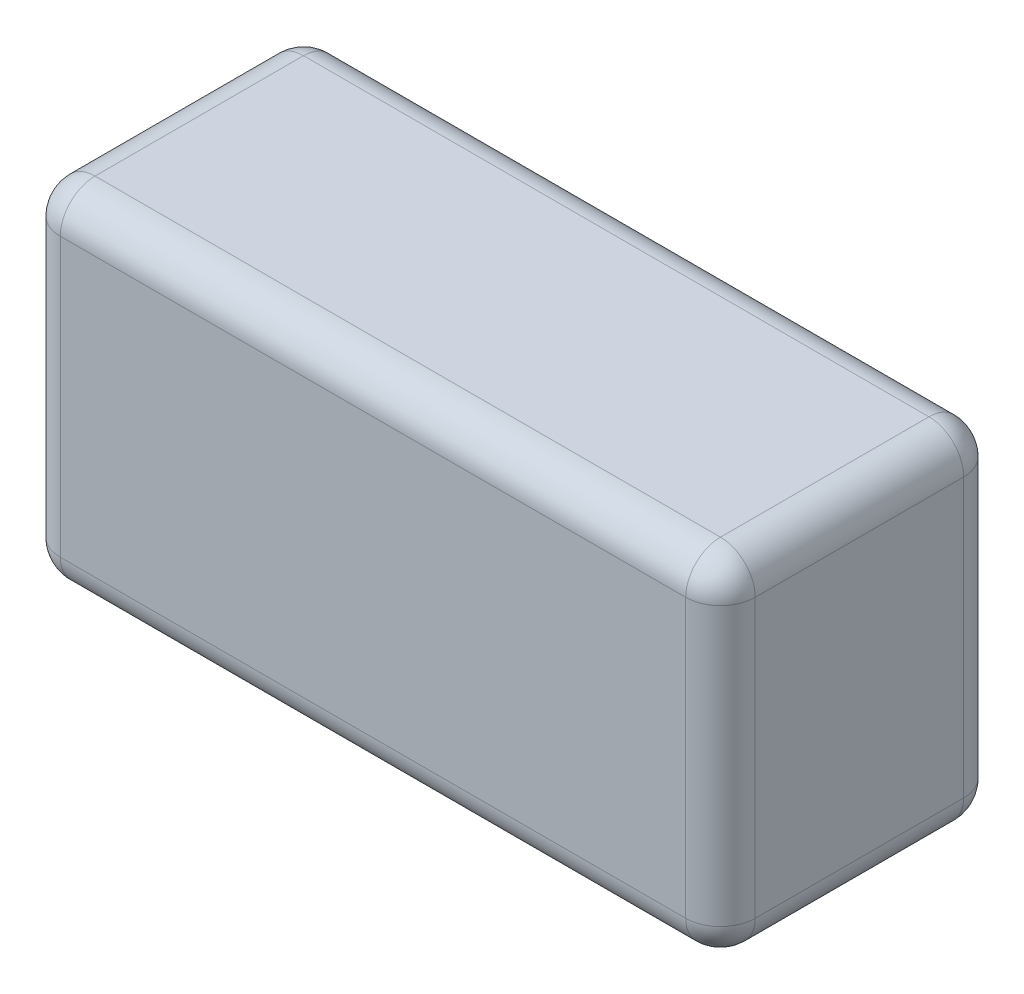
ISO-10303-21;
HEADER;
FILE_DESCRIPTION(('STEP AP214'),'2;1');
FILE_NAME('part.step','',(''),(''),'','','');
FILE_SCHEMA(('AUTOMOTIVE_DESIGN { 1 0 10303 214 1 1 1 1 }'));
ENDSEC;
DATA;
#1=APPLICATION_CONTEXT('core data for automotive mechanical design processes');
#2=APPLICATION_PROTOCOL_DEFINITION('international standard','automotive_design',2000,#1);
#3=PRODUCT_CONTEXT('',#1,'mechanical');
#4=PRODUCT('Part','Part','',(#3));
#5=PRODUCT_RELATED_PRODUCT_CATEGORY('part','',(#4));
#6=PRODUCT_DEFINITION_FORMATION('','',#4);
#7=PRODUCT_DEFINITION_CONTEXT('part definition',#1,'design');
#8=PRODUCT_DEFINITION('design','',#6,#7);
#9=PRODUCT_DEFINITION_SHAPE('','',#8);
#10=(LENGTH_UNIT() NAMED_UNIT(*) SI_UNIT(.MILLI.,.METRE.));
#11=(NAMED_UNIT(*) PLANE_ANGLE_UNIT() SI_UNIT($,.RADIAN.));
#12=(NAMED_UNIT(*) SI_UNIT($,.STERADIAN.) SOLID_ANGLE_UNIT());
#13=UNCERTAINTY_MEASURE_WITH_UNIT(LENGTH_MEASURE(1.E-05),#10,'distance_accuracy_value','');
#14=(GEOMETRIC_REPRESENTATION_CONTEXT(3) GLOBAL_UNCERTAINTY_ASSIGNED_CONTEXT((#13)) GLOBAL_UNIT_ASSIGNED_CONTEXT((#10,
#11,#12)) REPRESENTATION_CONTEXT('',''));
#15=CARTESIAN_POINT('',(0.,0.,0.));
#16=DIRECTION('',(0.,0.,1.));
#17=DIRECTION('',(1.,0.,0.));
#18=AXIS2_PLACEMENT_3D('',#15,#16,#17);
#19=CARTESIAN_POINT('',(31.75,-15.875,25.4));
#20=DIRECTION('',(-1.,0.,0.));
#21=DIRECTION('',(0.,0.,1.));
#22=AXIS2_PLACEMENT_3D('',#19,#20,#21);
#23=PLANE('',#22);
#24=DIRECTION('',(0.,0.,-1.));
#25=VECTOR('',#24,1.);
#26=CARTESIAN_POINT('',(31.75,12.7,25.4));
#27=LINE('',#26,#25);
#28=CARTESIAN_POINT('',(31.75,12.7,3.175));
#29=VERTEX_POINT('',#28);
#30=CARTESIAN_POINT('',(31.75,12.7,22.225));
#31=VERTEX_POINT('',#30);
#32=EDGE_CURVE('E135',#29,#31,#27,.F.);
#33=ORIENTED_EDGE('',*,*,#32,.T.);
#34=DIRECTION('',(0.,1.,0.));
#35=VECTOR('',#34,1.);
#36=CARTESIAN_POINT('',(31.75,-15.875,22.225));
#37=LINE('',#36,#35);
#38=CARTESIAN_POINT('',(31.75,-12.7,22.225));
#39=VERTEX_POINT('',#38);
#40=EDGE_CURVE('E172',#31,#39,#37,.F.);
#41=ORIENTED_EDGE('',*,*,#40,.T.);
#42=DIRECTION('',(0.,0.,-1.));
#43=VECTOR('',#42,1.);
#44=CARTESIAN_POINT('',(31.75,-12.7,25.4));
#45=LINE('',#44,#43);
#46=CARTESIAN_POINT('',(31.75,-12.7,3.175));
#47=VERTEX_POINT('',#46);
#48=EDGE_CURVE('E169',#39,#47,#45,.T.);
#49=ORIENTED_EDGE('',*,*,#48,.T.);
#50=DIRECTION('',(0.,1.,0.));
#51=VECTOR('',#50,1.);
#52=CARTESIAN_POINT('',(31.75,15.875,3.175));
#53=LINE('',#52,#51);
#54=EDGE_CURVE('E164',#47,#29,#53,.T.);
#55=ORIENTED_EDGE('',*,*,#54,.T.);
#56=EDGE_LOOP('',(#33,#41,#49,#55));
#57=FACE_BOUND('',#56,.T.);
#58=ADVANCED_FACE('F40',(#57),#23,.F.);
#59=CARTESIAN_POINT('',(-31.75,15.875,25.4));
#60=DIRECTION('',(0.,-1.,0.));
#61=DIRECTION('',(0.,0.,-1.));
#62=AXIS2_PLACEMENT_3D('',#59,#60,#61);
#63=PLANE('',#62);
#64=DIRECTION('',(0.,0.,-1.));
#65=VECTOR('',#64,1.);
#66=CARTESIAN_POINT('',(-28.575,15.875,25.4));
#67=LINE('',#66,#65);
#68=CARTESIAN_POINT('',(-28.575,15.875,3.175));
#69=VERTEX_POINT('',#68);
#70=CARTESIAN_POINT('',(-28.575,15.875,22.225));
#71=VERTEX_POINT('',#70);
#72=EDGE_CURVE('E157',#69,#71,#67,.F.);
#73=ORIENTED_EDGE('',*,*,#72,.T.);
#74=DIRECTION('',(-1.,0.,0.));
#75=VECTOR('',#74,1.);
#76=CARTESIAN_POINT('',(-31.75,15.875,22.225));
#77=LINE('',#76,#75);
#78=CARTESIAN_POINT('',(28.575,15.875,22.225));
#79=VERTEX_POINT('',#78);
#80=EDGE_CURVE('E161',#71,#79,#77,.F.);
#81=ORIENTED_EDGE('',*,*,#80,.T.);
#82=DIRECTION('',(0.,0.,-1.));
#83=VECTOR('',#82,1.);
#84=CARTESIAN_POINT('',(28.575,15.875,25.4));
#85=LINE('',#84,#83);
#86=CARTESIAN_POINT('',(28.575,15.875,3.175));
#87=VERTEX_POINT('',#86);
#88=EDGE_CURVE('E133',#79,#87,#85,.T.);
#89=ORIENTED_EDGE('',*,*,#88,.T.);
#90=DIRECTION('',(-1.,0.,0.));
#91=VECTOR('',#90,1.);
#92=CARTESIAN_POINT('',(-31.75,15.875,3.175));
#93=LINE('',#92,#91);
#94=EDGE_CURVE('E151',#87,#69,#93,.T.);
#95=ORIENTED_EDGE('',*,*,#94,.T.);
#96=EDGE_LOOP('',(#73,#81,#89,#95));
#97=FACE_BOUND('',#96,.T.);
#98=ADVANCED_FACE('F159',(#97),#63,.F.);
#99=CARTESIAN_POINT('',(-31.75,-15.875,25.4));
#100=DIRECTION('',(1.,0.,0.));
#101=DIRECTION('',(0.,0.,-1.));
#102=AXIS2_PLACEMENT_3D('',#99,#100,#101);
#103=PLANE('',#102);
#104=DIRECTION('',(0.,0.,-1.));
#105=VECTOR('',#104,1.);
#106=CARTESIAN_POINT('',(-31.75,-12.7,25.4));
#107=LINE('',#106,#105);
#108=CARTESIAN_POINT('',(-31.75,-12.7,3.175));
#109=VERTEX_POINT('',#108);
#110=CARTESIAN_POINT('',(-31.75,-12.7,22.225));
#111=VERTEX_POINT('',#110);
#112=EDGE_CURVE('E176',#109,#111,#107,.F.);
#113=ORIENTED_EDGE('',*,*,#112,.T.);
#114=DIRECTION('',(0.,-1.,0.));
#115=VECTOR('',#114,1.);
#116=CARTESIAN_POINT('',(-31.75,-15.875,22.225));
#117=LINE('',#116,#115);
#118=CARTESIAN_POINT('',(-31.75,12.7,22.225));
#119=VERTEX_POINT('',#118);
#120=EDGE_CURVE('E181',#111,#119,#117,.F.);
#121=ORIENTED_EDGE('',*,*,#120,.T.);
#122=DIRECTION('',(0.,0.,-1.));
#123=VECTOR('',#122,1.);
#124=CARTESIAN_POINT('',(-31.75,12.7,25.4));
#125=LINE('',#124,#123);
#126=CARTESIAN_POINT('',(-31.75,12.7,3.175));
#127=VERTEX_POINT('',#126);
#128=EDGE_CURVE('E178',#119,#127,#125,.T.);
#129=ORIENTED_EDGE('',*,*,#128,.T.);
#130=DIRECTION('',(0.,-1.,0.));
#131=VECTOR('',#130,1.);
#132=CARTESIAN_POINT('',(-31.75,-15.875,3.175));
#133=LINE('',#132,#131);
#134=EDGE_CURVE('E174',#127,#109,#133,.T.);
#135=ORIENTED_EDGE('',*,*,#134,.T.);
#136=EDGE_LOOP('',(#113,#121,#129,#135));
#137=FACE_BOUND('',#136,.T.);
#138=ADVANCED_FACE('F286',(#137),#103,.F.);
#139=CARTESIAN_POINT('',(-31.75,-15.875,25.4));
#140=DIRECTION('',(0.,1.,0.));
#141=DIRECTION('',(0.,0.,1.));
#142=AXIS2_PLACEMENT_3D('',#139,#140,#141);
#143=PLANE('',#142);
#144=DIRECTION('',(0.,0.,-1.));
#145=VECTOR('',#144,1.);
#146=CARTESIAN_POINT('',(28.575,-15.875,25.4));
#147=LINE('',#146,#145);
#148=CARTESIAN_POINT('',(28.575,-15.875,3.175));
#149=VERTEX_POINT('',#148);
#150=CARTESIAN_POINT('',(28.575,-15.875,22.225));
#151=VERTEX_POINT('',#150);
#152=EDGE_CURVE('E185',#149,#151,#147,.F.);
#153=ORIENTED_EDGE('',*,*,#152,.T.);
#154=DIRECTION('',(1.,0.,0.));
#155=VECTOR('',#154,1.);
#156=CARTESIAN_POINT('',(-31.75,-15.875,22.225));
#157=LINE('',#156,#155);
#158=CARTESIAN_POINT('',(-28.575,-15.875,22.225));
#159=VERTEX_POINT('',#158);
#160=EDGE_CURVE('E190',#151,#159,#157,.F.);
#161=ORIENTED_EDGE('',*,*,#160,.T.);
#162=DIRECTION('',(0.,0.,-1.));
#163=VECTOR('',#162,1.);
#164=CARTESIAN_POINT('',(-28.575,-15.875,25.4));
#165=LINE('',#164,#163);
#166=CARTESIAN_POINT('',(-28.575,-15.875,3.175));
#167=VERTEX_POINT('',#166);
#168=EDGE_CURVE('E187',#159,#167,#165,.T.);
#169=ORIENTED_EDGE('',*,*,#168,.T.);
#170=DIRECTION('',(1.,0.,0.));
#171=VECTOR('',#170,1.);
#172=CARTESIAN_POINT('',(31.75,-15.875,3.175));
#173=LINE('',#172,#171);
#174=EDGE_CURVE('E183',#167,#149,#173,.T.);
#175=ORIENTED_EDGE('',*,*,#174,.T.);
#176=EDGE_LOOP('',(#153,#161,#169,#175));
#177=FACE_BOUND('',#176,.T.);
#178=ADVANCED_FACE('F296',(#177),#143,.F.);
#179=CARTESIAN_POINT('',(0.,0.,25.4));
#180=DIRECTION('',(0.,0.,-1.));
#181=DIRECTION('',(-1.,0.,0.));
#182=AXIS2_PLACEMENT_3D('',#179,#180,#181);
#183=PLANE('',#182);
#184=DIRECTION('',(0.,-1.,0.));
#185=VECTOR('',#184,1.);
#186=CARTESIAN_POINT('',(-28.575,0.,25.4));
#187=LINE('',#186,#185);
#188=CARTESIAN_POINT('',(-28.575,12.7,25.4));
#189=VERTEX_POINT('',#188);
#190=CARTESIAN_POINT('',(-28.575,-12.7,25.4));
#191=VERTEX_POINT('',#190);
#192=EDGE_CURVE('E196',#189,#191,#187,.T.);
#193=ORIENTED_EDGE('',*,*,#192,.T.);
#194=DIRECTION('',(1.,0.,0.));
#195=VECTOR('',#194,1.);
#196=CARTESIAN_POINT('',(0.,-12.7,25.4));
#197=LINE('',#196,#195);
#198=CARTESIAN_POINT('',(28.575,-12.7,25.4));
#199=VERTEX_POINT('',#198);
#200=EDGE_CURVE('E198',#191,#199,#197,.T.);
#201=ORIENTED_EDGE('',*,*,#200,.T.);
#202=DIRECTION('',(0.,1.,0.));
#203=VECTOR('',#202,1.);
#204=CARTESIAN_POINT('',(28.575,0.,25.4));
#205=LINE('',#204,#203);
#206=CARTESIAN_POINT('',(28.575,12.7,25.4));
#207=VERTEX_POINT('',#206);
#208=EDGE_CURVE('E192',#199,#207,#205,.T.);
#209=ORIENTED_EDGE('',*,*,#208,.T.);
#210=DIRECTION('',(-1.,0.,0.));
#211=VECTOR('',#210,1.);
#212=CARTESIAN_POINT('',(0.,12.7,25.4));
#213=LINE('',#212,#211);
#214=EDGE_CURVE('E194',#207,#189,#213,.T.);
#215=ORIENTED_EDGE('',*,*,#214,.T.);
#216=EDGE_LOOP('',(#193,#201,#209,#215));
#217=FACE_BOUND('',#216,.T.);
#218=ADVANCED_FACE('F278',(#217),#183,.F.);
#219=CARTESIAN_POINT('',(0.,0.,0.));
#220=DIRECTION('',(0.,0.,-1.));
#221=DIRECTION('',(-1.,0.,0.));
#222=AXIS2_PLACEMENT_3D('',#219,#220,#221);
#223=PLANE('',#222);
#224=DIRECTION('',(0.,1.,0.));
#225=VECTOR('',#224,1.);
#226=CARTESIAN_POINT('',(28.575,-15.875,0.));
#227=LINE('',#226,#225);
#228=CARTESIAN_POINT('',(28.575,12.7,0.));
#229=VERTEX_POINT('',#228);
#230=CARTESIAN_POINT('',(28.575,-12.7,0.));
#231=VERTEX_POINT('',#230);
#232=EDGE_CURVE('E201',#229,#231,#227,.F.);
#233=ORIENTED_EDGE('',*,*,#232,.T.);
#234=DIRECTION('',(1.,0.,0.));
#235=VECTOR('',#234,1.);
#236=CARTESIAN_POINT('',(-31.75,-12.7,0.));
#237=LINE('',#236,#235);
#238=CARTESIAN_POINT('',(-28.575,-12.7,0.));
#239=VERTEX_POINT('',#238);
#240=EDGE_CURVE('E11',#231,#239,#237,.F.);
#241=ORIENTED_EDGE('',*,*,#240,.T.);
#242=DIRECTION('',(0.,-1.,0.));
#243=VECTOR('',#242,1.);
#244=CARTESIAN_POINT('',(-28.575,15.875,0.));
#245=LINE('',#244,#243);
#246=CARTESIAN_POINT('',(-28.575,12.7,0.));
#247=VERTEX_POINT('',#246);
#248=EDGE_CURVE('E49',#239,#247,#245,.F.);
#249=ORIENTED_EDGE('',*,*,#248,.T.);
#250=DIRECTION('',(-1.,0.,0.));
#251=VECTOR('',#250,1.);
#252=CARTESIAN_POINT('',(31.75,12.7,0.));
#253=LINE('',#252,#251);
#254=EDGE_CURVE('E203',#247,#229,#253,.F.);
#255=ORIENTED_EDGE('',*,*,#254,.T.);
#256=EDGE_LOOP('',(#233,#241,#249,#255));
#257=FACE_BOUND('',#256,.T.);
#258=ADVANCED_FACE('F485',(#257),#223,.T.);
#259=CARTESIAN_POINT('',(-28.575,-12.7,25.4));
#260=DIRECTION('',(0.,0.,-1.));
#261=DIRECTION('',(-1.,0.,0.));
#262=AXIS2_PLACEMENT_3D('',#259,#260,#261);
#263=CYLINDRICAL_SURFACE('',#262,3.175);
#264=CARTESIAN_POINT('',(-28.575,-12.7,22.225));
#265=DIRECTION('',(0.,0.,1.));
#266=DIRECTION('',(1.,0.,0.));
#267=AXIS2_PLACEMENT_3D('',#264,#265,#266);
#268=CIRCLE('',#267,3.175);
#269=EDGE_CURVE('E44',#111,#159,#268,.T.);
#270=ORIENTED_EDGE('',*,*,#269,.F.);
#271=ORIENTED_EDGE('',*,*,#112,.F.);
#272=CARTESIAN_POINT('',(-28.575,-12.7,3.175));
#273=DIRECTION('',(0.,0.,-1.));
#274=DIRECTION('',(-1.,0.,0.));
#275=AXIS2_PLACEMENT_3D('',#272,#273,#274);
#276=CIRCLE('',#275,3.175);
#277=EDGE_CURVE('E256',#167,#109,#276,.T.);
#278=ORIENTED_EDGE('',*,*,#277,.F.);
#279=ORIENTED_EDGE('',*,*,#168,.F.);
#280=EDGE_LOOP('',(#270,#271,#278,#279));
#281=FACE_BOUND('',#280,.T.);
#282=ADVANCED_FACE('F42',(#281),#263,.T.);
#283=CARTESIAN_POINT('',(-28.575,-12.7,22.225));
#284=DIRECTION('',(0.,0.,1.));
#285=DIRECTION('',(1.,0.,0.));
#286=AXIS2_PLACEMENT_3D('',#283,#284,#285);
#287=SPHERICAL_SURFACE('',#286,3.175);
#288=CARTESIAN_POINT('',(-28.575,-12.7,22.225));
#289=DIRECTION('',(0.,-1.,0.));
#290=DIRECTION('',(0.,0.,-1.));
#291=AXIS2_PLACEMENT_3D('',#288,#289,#290);
#292=CIRCLE('',#291,3.175);
#293=EDGE_CURVE('E251',#111,#191,#292,.F.);
#294=ORIENTED_EDGE('',*,*,#293,.F.);
#295=ORIENTED_EDGE('',*,*,#269,.T.);
#296=CARTESIAN_POINT('',(-28.575,-12.7,22.225));
#297=DIRECTION('',(-1.,0.,0.));
#298=DIRECTION('',(0.,0.,1.));
#299=AXIS2_PLACEMENT_3D('',#296,#297,#298);
#300=CIRCLE('',#299,3.175);
#301=EDGE_CURVE('E254',#191,#159,#300,.F.);
#302=ORIENTED_EDGE('',*,*,#301,.F.);
#303=EDGE_LOOP('',(#294,#295,#302));
#304=FACE_BOUND('',#303,.T.);
#305=ADVANCED_FACE('F266',(#304),#287,.T.);
#306=CARTESIAN_POINT('',(-28.575,-12.7,3.175));
#307=DIRECTION('',(0.,0.,1.));
#308=DIRECTION('',(1.,0.,0.));
#309=AXIS2_PLACEMENT_3D('',#306,#307,#308);
#310=SPHERICAL_SURFACE('',#309,3.175);
#311=CARTESIAN_POINT('',(-28.575,-12.7,3.175));
#312=DIRECTION('',(-1.,0.,0.));
#313=DIRECTION('',(0.,0.,1.));
#314=AXIS2_PLACEMENT_3D('',#311,#312,#313);
#315=CIRCLE('',#314,3.175);
#316=EDGE_CURVE('E246',#167,#239,#315,.F.);
#317=ORIENTED_EDGE('',*,*,#316,.F.);
#318=ORIENTED_EDGE('',*,*,#277,.T.);
#319=CARTESIAN_POINT('',(-28.575,-12.7,3.175));
#320=DIRECTION('',(0.,-1.,0.));
#321=DIRECTION('',(0.,0.,-1.));
#322=AXIS2_PLACEMENT_3D('',#319,#320,#321);
#323=CIRCLE('',#322,3.175);
#324=EDGE_CURVE('E249',#239,#109,#323,.F.);
#325=ORIENTED_EDGE('',*,*,#324,.F.);
#326=EDGE_LOOP('',(#317,#318,#325));
#327=FACE_BOUND('',#326,.T.);
#328=ADVANCED_FACE('F464',(#327),#310,.T.);
#329=CARTESIAN_POINT('',(0.,-12.7,22.225));
#330=DIRECTION('',(1.,0.,0.));
#331=DIRECTION('',(0.,0.,-1.));
#332=AXIS2_PLACEMENT_3D('',#329,#330,#331);
#333=CYLINDRICAL_SURFACE('',#332,3.175);
#334=ORIENTED_EDGE('',*,*,#301,.T.);
#335=ORIENTED_EDGE('',*,*,#160,.F.);
#336=CARTESIAN_POINT('',(28.575,-12.7,22.225));
#337=DIRECTION('',(1.,0.,0.));
#338=DIRECTION('',(0.,0.,-1.));
#339=AXIS2_PLACEMENT_3D('',#336,#337,#338);
#340=CIRCLE('',#339,3.175);
#341=EDGE_CURVE('E240',#199,#151,#340,.T.);
#342=ORIENTED_EDGE('',*,*,#341,.F.);
#343=ORIENTED_EDGE('',*,*,#200,.F.);
#344=EDGE_LOOP('',(#334,#335,#342,#343));
#345=FACE_BOUND('',#344,.T.);
#346=ADVANCED_FACE('F274',(#345),#333,.T.);
#347=CARTESIAN_POINT('',(-28.575,0.,22.225));
#348=DIRECTION('',(0.,-1.,0.));
#349=DIRECTION('',(0.,0.,-1.));
#350=AXIS2_PLACEMENT_3D('',#347,#348,#349);
#351=CYLINDRICAL_SURFACE('',#350,3.175);
#352=ORIENTED_EDGE('',*,*,#293,.T.);
#353=ORIENTED_EDGE('',*,*,#192,.F.);
#354=CARTESIAN_POINT('',(-28.575,12.7,22.225));
#355=DIRECTION('',(0.,1.,0.));
#356=DIRECTION('',(0.,0.,1.));
#357=AXIS2_PLACEMENT_3D('',#354,#355,#356);
#358=CIRCLE('',#357,3.175);
#359=EDGE_CURVE('E237',#119,#189,#358,.T.);
#360=ORIENTED_EDGE('',*,*,#359,.F.);
#361=ORIENTED_EDGE('',*,*,#120,.F.);
#362=EDGE_LOOP('',(#352,#353,#360,#361));
#363=FACE_BOUND('',#362,.T.);
#364=ADVANCED_FACE('F283',(#363),#351,.T.);
#365=CARTESIAN_POINT('',(-28.575,12.7,25.4));
#366=DIRECTION('',(0.,0.,-1.));
#367=DIRECTION('',(-1.,0.,0.));
#368=AXIS2_PLACEMENT_3D('',#365,#366,#367);
#369=CYLINDRICAL_SURFACE('',#368,3.175);
#370=CARTESIAN_POINT('',(-28.575,12.7,3.175));
#371=DIRECTION('',(0.,0.,-1.));
#372=DIRECTION('',(-1.,0.,0.));
#373=AXIS2_PLACEMENT_3D('',#370,#371,#372);
#374=CIRCLE('',#373,3.175);
#375=EDGE_CURVE('E231',#127,#69,#374,.T.);
#376=ORIENTED_EDGE('',*,*,#375,.F.);
#377=ORIENTED_EDGE('',*,*,#128,.F.);
#378=CARTESIAN_POINT('',(-28.575,12.7,22.225));
#379=DIRECTION('',(0.,0.,1.));
#380=DIRECTION('',(1.,0.,0.));
#381=AXIS2_PLACEMENT_3D('',#378,#379,#380);
#382=CIRCLE('',#381,3.175);
#383=EDGE_CURVE('E234',#71,#119,#382,.T.);
#384=ORIENTED_EDGE('',*,*,#383,.F.);
#385=ORIENTED_EDGE('',*,*,#72,.F.);
#386=EDGE_LOOP('',(#376,#377,#384,#385));
#387=FACE_BOUND('',#386,.T.);
#388=ADVANCED_FACE('F290',(#387),#369,.T.);
#389=CARTESIAN_POINT('',(-28.575,-15.875,3.175));
#390=DIRECTION('',(0.,1.,0.));
#391=DIRECTION('',(0.,0.,1.));
#392=AXIS2_PLACEMENT_3D('',#389,#390,#391);
#393=CYLINDRICAL_SURFACE('',#392,3.175);
#394=ORIENTED_EDGE('',*,*,#324,.T.);
#395=ORIENTED_EDGE('',*,*,#134,.F.);
#396=CARTESIAN_POINT('',(-28.575,12.7,3.175));
#397=DIRECTION('',(0.,1.,0.));
#398=DIRECTION('',(0.,0.,1.));
#399=AXIS2_PLACEMENT_3D('',#396,#397,#398);
#400=CIRCLE('',#399,3.175);
#401=EDGE_CURVE('E229',#247,#127,#400,.T.);
#402=ORIENTED_EDGE('',*,*,#401,.F.);
#403=ORIENTED_EDGE('',*,*,#248,.F.);
#404=EDGE_LOOP('',(#394,#395,#402,#403));
#405=FACE_BOUND('',#404,.T.);
#406=ADVANCED_FACE('F294',(#405),#393,.T.);
#407=CARTESIAN_POINT('',(-31.75,-12.7,3.175));
#408=DIRECTION('',(-1.,0.,0.));
#409=DIRECTION('',(0.,0.,1.));
#410=AXIS2_PLACEMENT_3D('',#407,#408,#409);
#411=CYLINDRICAL_SURFACE('',#410,3.175);
#412=ORIENTED_EDGE('',*,*,#316,.T.);
#413=ORIENTED_EDGE('',*,*,#240,.F.);
#414=CARTESIAN_POINT('',(28.575,-12.7,3.175));
#415=DIRECTION('',(1.,0.,0.));
#416=DIRECTION('',(0.,0.,-1.));
#417=AXIS2_PLACEMENT_3D('',#414,#415,#416);
#418=CIRCLE('',#417,3.175);
#419=EDGE_CURVE('E226',#149,#231,#418,.T.);
#420=ORIENTED_EDGE('',*,*,#419,.F.);
#421=ORIENTED_EDGE('',*,*,#174,.F.);
#422=EDGE_LOOP('',(#412,#413,#420,#421));
#423=FACE_BOUND('',#422,.T.);
#424=ADVANCED_FACE('F306',(#423),#411,.T.);
#425=CARTESIAN_POINT('',(28.575,-12.7,25.4));
#426=DIRECTION('',(0.,0.,-1.));
#427=DIRECTION('',(-1.,0.,0.));
#428=AXIS2_PLACEMENT_3D('',#425,#426,#427);
#429=CYLINDRICAL_SURFACE('',#428,3.175);
#430=CARTESIAN_POINT('',(28.575,-12.7,22.225));
#431=DIRECTION('',(0.,0.,1.));
#432=DIRECTION('',(1.,0.,0.));
#433=AXIS2_PLACEMENT_3D('',#430,#431,#432);
#434=CIRCLE('',#433,3.175);
#435=EDGE_CURVE('E243',#151,#39,#434,.T.);
#436=ORIENTED_EDGE('',*,*,#435,.F.);
#437=ORIENTED_EDGE('',*,*,#152,.F.);
#438=CARTESIAN_POINT('',(28.575,-12.7,3.175));
#439=DIRECTION('',(0.,0.,-1.));
#440=DIRECTION('',(-1.,0.,0.));
#441=AXIS2_PLACEMENT_3D('',#438,#439,#440);
#442=CIRCLE('',#441,3.175);
#443=EDGE_CURVE('E223',#47,#149,#442,.T.);
#444=ORIENTED_EDGE('',*,*,#443,.F.);
#445=ORIENTED_EDGE('',*,*,#48,.F.);
#446=EDGE_LOOP('',(#436,#437,#444,#445));
#447=FACE_BOUND('',#446,.T.);
#448=ADVANCED_FACE('F301',(#447),#429,.T.);
#449=CARTESIAN_POINT('',(28.575,-12.7,22.225));
#450=DIRECTION('',(0.,0.,1.));
#451=DIRECTION('',(1.,0.,0.));
#452=AXIS2_PLACEMENT_3D('',#449,#450,#451);
#453=SPHERICAL_SURFACE('',#452,3.175);
#454=ORIENTED_EDGE('',*,*,#341,.T.);
#455=ORIENTED_EDGE('',*,*,#435,.T.);
#456=CARTESIAN_POINT('',(28.575,-12.7,22.225));
#457=DIRECTION('',(0.,-1.,0.));
#458=DIRECTION('',(0.,0.,-1.));
#459=AXIS2_PLACEMENT_3D('',#456,#457,#458);
#460=CIRCLE('',#459,3.175);
#461=EDGE_CURVE('E220',#199,#39,#460,.F.);
#462=ORIENTED_EDGE('',*,*,#461,.F.);
#463=EDGE_LOOP('',(#454,#455,#462));
#464=FACE_BOUND('',#463,.T.);
#465=ADVANCED_FACE('F317',(#464),#453,.T.);
#466=CARTESIAN_POINT('',(-28.575,12.7,22.225));
#467=DIRECTION('',(0.,0.,1.));
#468=DIRECTION('',(1.,0.,0.));
#469=AXIS2_PLACEMENT_3D('',#466,#467,#468);
#470=SPHERICAL_SURFACE('',#469,3.175);
#471=ORIENTED_EDGE('',*,*,#383,.T.);
#472=ORIENTED_EDGE('',*,*,#359,.T.);
#473=CARTESIAN_POINT('',(-28.575,12.7,22.225));
#474=DIRECTION('',(-1.,0.,0.));
#475=DIRECTION('',(0.,0.,1.));
#476=AXIS2_PLACEMENT_3D('',#473,#474,#475);
#477=CIRCLE('',#476,3.175);
#478=EDGE_CURVE('E217',#71,#189,#477,.F.);
#479=ORIENTED_EDGE('',*,*,#478,.F.);
#480=EDGE_LOOP('',(#471,#472,#479));
#481=FACE_BOUND('',#480,.T.);
#482=ADVANCED_FACE('F327',(#481),#470,.T.);
#483=CARTESIAN_POINT('',(-28.575,12.7,3.175));
#484=DIRECTION('',(0.,0.,1.));
#485=DIRECTION('',(1.,0.,0.));
#486=AXIS2_PLACEMENT_3D('',#483,#484,#485);
#487=SPHERICAL_SURFACE('',#486,3.175);
#488=ORIENTED_EDGE('',*,*,#401,.T.);
#489=ORIENTED_EDGE('',*,*,#375,.T.);
#490=CARTESIAN_POINT('',(-28.575,12.7,3.175));
#491=DIRECTION('',(-1.,0.,0.));
#492=DIRECTION('',(0.,0.,1.));
#493=AXIS2_PLACEMENT_3D('',#490,#491,#492);
#494=CIRCLE('',#493,3.175);
#495=EDGE_CURVE('E154',#247,#69,#494,.F.);
#496=ORIENTED_EDGE('',*,*,#495,.F.);
#497=EDGE_LOOP('',(#488,#489,#496));
#498=FACE_BOUND('',#497,.T.);
#499=ADVANCED_FACE('F329',(#498),#487,.T.);
#500=CARTESIAN_POINT('',(28.575,-12.7,3.175));
#501=DIRECTION('',(0.,0.,1.));
#502=DIRECTION('',(1.,0.,0.));
#503=AXIS2_PLACEMENT_3D('',#500,#501,#502);
#504=SPHERICAL_SURFACE('',#503,3.175);
#505=ORIENTED_EDGE('',*,*,#443,.T.);
#506=ORIENTED_EDGE('',*,*,#419,.T.);
#507=CARTESIAN_POINT('',(28.575,-12.7,3.175));
#508=DIRECTION('',(0.,-1.,0.));
#509=DIRECTION('',(0.,0.,-1.));
#510=AXIS2_PLACEMENT_3D('',#507,#508,#509);
#511=CIRCLE('',#510,3.175);
#512=EDGE_CURVE('E213',#47,#231,#511,.F.);
#513=ORIENTED_EDGE('',*,*,#512,.F.);
#514=EDGE_LOOP('',(#505,#506,#513));
#515=FACE_BOUND('',#514,.T.);
#516=ADVANCED_FACE('F308',(#515),#504,.T.);
#517=CARTESIAN_POINT('',(28.575,0.,22.225));
#518=DIRECTION('',(0.,1.,0.));
#519=DIRECTION('',(0.,0.,1.));
#520=AXIS2_PLACEMENT_3D('',#517,#518,#519);
#521=CYLINDRICAL_SURFACE('',#520,3.175);
#522=ORIENTED_EDGE('',*,*,#461,.T.);
#523=ORIENTED_EDGE('',*,*,#40,.F.);
#524=CARTESIAN_POINT('',(28.575,12.7,22.225));
#525=DIRECTION('',(0.,1.,0.));
#526=DIRECTION('',(0.,0.,1.));
#527=AXIS2_PLACEMENT_3D('',#524,#525,#526);
#528=CIRCLE('',#527,3.175);
#529=EDGE_CURVE('E210',#207,#31,#528,.T.);
#530=ORIENTED_EDGE('',*,*,#529,.F.);
#531=ORIENTED_EDGE('',*,*,#208,.F.);
#532=EDGE_LOOP('',(#522,#523,#530,#531));
#533=FACE_BOUND('',#532,.T.);
#534=ADVANCED_FACE('F319',(#533),#521,.T.);
#535=CARTESIAN_POINT('',(0.,12.7,22.225));
#536=DIRECTION('',(-1.,0.,0.));
#537=DIRECTION('',(0.,0.,1.));
#538=AXIS2_PLACEMENT_3D('',#535,#536,#537);
#539=CYLINDRICAL_SURFACE('',#538,3.175);
#540=ORIENTED_EDGE('',*,*,#478,.T.);
#541=ORIENTED_EDGE('',*,*,#214,.F.);
#542=CARTESIAN_POINT('',(28.575,12.7,22.225));
#543=DIRECTION('',(1.,0.,0.));
#544=DIRECTION('',(0.,0.,-1.));
#545=AXIS2_PLACEMENT_3D('',#542,#543,#544);
#546=CIRCLE('',#545,3.175);
#547=EDGE_CURVE('E148',#79,#207,#546,.T.);
#548=ORIENTED_EDGE('',*,*,#547,.F.);
#549=ORIENTED_EDGE('',*,*,#80,.F.);
#550=EDGE_LOOP('',(#540,#541,#548,#549));
#551=FACE_BOUND('',#550,.T.);
#552=ADVANCED_FACE('F325',(#551),#539,.T.);
#553=CARTESIAN_POINT('',(-31.75,12.7,3.175));
#554=DIRECTION('',(1.,0.,0.));
#555=DIRECTION('',(0.,0.,-1.));
#556=AXIS2_PLACEMENT_3D('',#553,#554,#555);
#557=CYLINDRICAL_SURFACE('',#556,3.175);
#558=ORIENTED_EDGE('',*,*,#495,.T.);
#559=ORIENTED_EDGE('',*,*,#94,.F.);
#560=CARTESIAN_POINT('',(28.575,12.7,3.175));
#561=DIRECTION('',(1.,0.,0.));
#562=DIRECTION('',(0.,1.,0.));
#563=AXIS2_PLACEMENT_3D('',#560,#561,#562);
#564=CIRCLE('',#563,3.175);
#565=EDGE_CURVE('E141',#229,#87,#564,.T.);
#566=ORIENTED_EDGE('',*,*,#565,.F.);
#567=ORIENTED_EDGE('',*,*,#254,.F.);
#568=EDGE_LOOP('',(#558,#559,#566,#567));
#569=FACE_BOUND('',#568,.T.);
#570=ADVANCED_FACE('F152',(#569),#557,.T.);
#571=CARTESIAN_POINT('',(28.575,-15.875,3.175));
#572=DIRECTION('',(0.,-1.,0.));
#573=DIRECTION('',(0.,0.,-1.));
#574=AXIS2_PLACEMENT_3D('',#571,#572,#573);
#575=CYLINDRICAL_SURFACE('',#574,3.175);
#576=ORIENTED_EDGE('',*,*,#512,.T.);
#577=ORIENTED_EDGE('',*,*,#232,.F.);
#578=CARTESIAN_POINT('',(28.575,12.7,3.175));
#579=DIRECTION('',(0.,1.,0.));
#580=DIRECTION('',(0.,0.,1.));
#581=AXIS2_PLACEMENT_3D('',#578,#579,#580);
#582=CIRCLE('',#581,3.175);
#583=EDGE_CURVE('E145',#29,#229,#582,.T.);
#584=ORIENTED_EDGE('',*,*,#583,.F.);
#585=ORIENTED_EDGE('',*,*,#54,.F.);
#586=EDGE_LOOP('',(#576,#577,#584,#585));
#587=FACE_BOUND('',#586,.T.);
#588=ADVANCED_FACE('F312',(#587),#575,.T.);
#589=CARTESIAN_POINT('',(28.575,12.7,22.225));
#590=DIRECTION('',(0.,0.,1.));
#591=DIRECTION('',(1.,0.,0.));
#592=AXIS2_PLACEMENT_3D('',#589,#590,#591);
#593=SPHERICAL_SURFACE('',#592,3.175);
#594=ORIENTED_EDGE('',*,*,#547,.T.);
#595=ORIENTED_EDGE('',*,*,#529,.T.);
#596=CARTESIAN_POINT('',(28.575,12.7,22.225));
#597=DIRECTION('',(0.,0.,1.));
#598=DIRECTION('',(1.,0.,0.));
#599=AXIS2_PLACEMENT_3D('',#596,#597,#598);
#600=CIRCLE('',#599,3.175);
#601=EDGE_CURVE('E138',#79,#31,#600,.F.);
#602=ORIENTED_EDGE('',*,*,#601,.F.);
#603=EDGE_LOOP('',(#594,#595,#602));
#604=FACE_BOUND('',#603,.T.);
#605=ADVANCED_FACE('F323',(#604),#593,.T.);
#606=CARTESIAN_POINT('',(28.575,12.7,3.175));
#607=DIRECTION('',(0.,0.,1.));
#608=DIRECTION('',(1.,0.,0.));
#609=AXIS2_PLACEMENT_3D('',#606,#607,#608);
#610=SPHERICAL_SURFACE('',#609,3.175);
#611=ORIENTED_EDGE('',*,*,#583,.T.);
#612=ORIENTED_EDGE('',*,*,#565,.T.);
#613=CARTESIAN_POINT('',(28.575,12.7,3.175));
#614=DIRECTION('',(0.,0.,-1.));
#615=DIRECTION('',(-1.,0.,0.));
#616=AXIS2_PLACEMENT_3D('',#613,#614,#615);
#617=CIRCLE('',#616,3.175);
#618=EDGE_CURVE('E129',#29,#87,#617,.F.);
#619=ORIENTED_EDGE('',*,*,#618,.F.);
#620=EDGE_LOOP('',(#611,#612,#619));
#621=FACE_BOUND('',#620,.T.);
#622=ADVANCED_FACE('F143',(#621),#610,.T.);
#623=CARTESIAN_POINT('',(28.575,12.7,25.4));
#624=DIRECTION('',(0.,0.,-1.));
#625=DIRECTION('',(-1.,0.,0.));
#626=AXIS2_PLACEMENT_3D('',#623,#624,#625);
#627=CYLINDRICAL_SURFACE('',#626,3.175);
#628=ORIENTED_EDGE('',*,*,#601,.T.);
#629=ORIENTED_EDGE('',*,*,#32,.F.);
#630=ORIENTED_EDGE('',*,*,#618,.T.);
#631=ORIENTED_EDGE('',*,*,#88,.F.);
#632=EDGE_LOOP('',(#628,#629,#630,#631));
#633=FACE_BOUND('',#632,.T.);
#634=ADVANCED_FACE('F131',(#633),#627,.T.);
#635=CLOSED_SHELL('',(#58,#98,#138,#178,#218,#258,#282,#305,#328,#346,#364,#388,#406,#424,#448,
#465,#482,#499,#516,#534,#552,#570,#588,#605,#622,#634));
#636=MANIFOLD_SOLID_BREP('B2',#635);
#637=ADVANCED_BREP_SHAPE_REPRESENTATION('',(#18,#636),#14);
#638=SHAPE_DEFINITION_REPRESENTATION(#9,#637);
ENDSEC;
END-ISO-10303-21;
